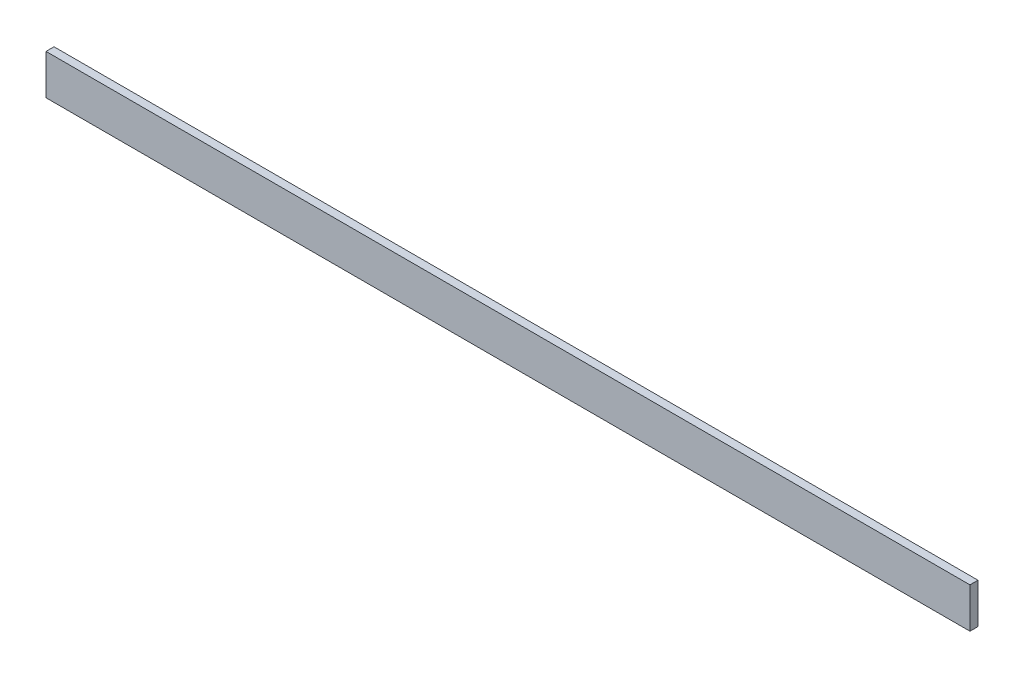
ISO-10303-21;
HEADER;
FILE_DESCRIPTION(('STEP AP214'),'2;1');
FILE_NAME('part.step','',(''),(''),'','','');
FILE_SCHEMA(('AUTOMOTIVE_DESIGN { 1 0 10303 214 1 1 1 1 }'));
ENDSEC;
DATA;
#1=APPLICATION_CONTEXT('core data for automotive mechanical design processes');
#2=APPLICATION_PROTOCOL_DEFINITION('international standard','automotive_design',2000,#1);
#3=PRODUCT_CONTEXT('',#1,'mechanical');
#4=PRODUCT('Part','Part','',(#3));
#5=PRODUCT_RELATED_PRODUCT_CATEGORY('part','',(#4));
#6=PRODUCT_DEFINITION_FORMATION('','',#4);
#7=PRODUCT_DEFINITION_CONTEXT('part definition',#1,'design');
#8=PRODUCT_DEFINITION('design','',#6,#7);
#9=PRODUCT_DEFINITION_SHAPE('','',#8);
#10=(LENGTH_UNIT() NAMED_UNIT(*) SI_UNIT(.MILLI.,.METRE.));
#11=(NAMED_UNIT(*) PLANE_ANGLE_UNIT() SI_UNIT($,.RADIAN.));
#12=(NAMED_UNIT(*) SI_UNIT($,.STERADIAN.) SOLID_ANGLE_UNIT());
#13=UNCERTAINTY_MEASURE_WITH_UNIT(LENGTH_MEASURE(1.E-05),#10,'distance_accuracy_value','');
#14=(GEOMETRIC_REPRESENTATION_CONTEXT(3) GLOBAL_UNCERTAINTY_ASSIGNED_CONTEXT((#13)) GLOBAL_UNIT_ASSIGNED_CONTEXT((#10,
#11,#12)) REPRESENTATION_CONTEXT('',''));
#15=CARTESIAN_POINT('',(0.,0.,0.));
#16=DIRECTION('',(0.,0.,1.));
#17=DIRECTION('',(1.,0.,0.));
#18=AXIS2_PLACEMENT_3D('',#15,#16,#17);
#19=CARTESIAN_POINT('',(0.,0.,4.));
#20=DIRECTION('',(1.,0.,0.));
#21=DIRECTION('',(0.,0.,-1.));
#22=AXIS2_PLACEMENT_3D('',#19,#20,#21);
#23=PLANE('',#22);
#24=DIRECTION('',(0.,-1.,0.));
#25=VECTOR('',#24,1.);
#26=CARTESIAN_POINT('',(0.,0.,0.));
#27=LINE('',#26,#25);
#28=CARTESIAN_POINT('',(0.,20.,0.));
#29=VERTEX_POINT('',#28);
#30=CARTESIAN_POINT('',(0.,0.,0.));
#31=VERTEX_POINT('',#30);
#32=EDGE_CURVE('E100',#29,#31,#27,.T.);
#33=ORIENTED_EDGE('',*,*,#32,.T.);
#34=DIRECTION('',(0.,0.,-1.));
#35=VECTOR('',#34,1.);
#36=CARTESIAN_POINT('',(0.,0.,4.));
#37=LINE('',#36,#35);
#38=CARTESIAN_POINT('',(0.,0.,4.));
#39=VERTEX_POINT('',#38);
#40=EDGE_CURVE('E11',#39,#31,#37,.T.);
#41=ORIENTED_EDGE('',*,*,#40,.F.);
#42=DIRECTION('',(0.,-1.,0.));
#43=VECTOR('',#42,1.);
#44=CARTESIAN_POINT('',(0.,0.,4.));
#45=LINE('',#44,#43);
#46=CARTESIAN_POINT('',(0.,20.,4.));
#47=VERTEX_POINT('',#46);
#48=EDGE_CURVE('E88',#47,#39,#45,.T.);
#49=ORIENTED_EDGE('',*,*,#48,.F.);
#50=DIRECTION('',(0.,0.,-1.));
#51=VECTOR('',#50,1.);
#52=CARTESIAN_POINT('',(0.,20.,4.));
#53=LINE('',#52,#51);
#54=EDGE_CURVE('E96',#47,#29,#53,.T.);
#55=ORIENTED_EDGE('',*,*,#54,.T.);
#56=EDGE_LOOP('',(#33,#41,#49,#55));
#57=FACE_BOUND('',#56,.T.);
#58=ADVANCED_FACE('F37',(#57),#23,.F.);
#59=CARTESIAN_POINT('',(0.,0.,4.));
#60=DIRECTION('',(0.,1.,0.));
#61=DIRECTION('',(0.,0.,1.));
#62=AXIS2_PLACEMENT_3D('',#59,#60,#61);
#63=PLANE('',#62);
#64=DIRECTION('',(1.,0.,0.));
#65=VECTOR('',#64,1.);
#66=CARTESIAN_POINT('',(0.,0.,0.));
#67=LINE('',#66,#65);
#68=CARTESIAN_POINT('',(460.,0.,0.));
#69=VERTEX_POINT('',#68);
#70=EDGE_CURVE('E92',#31,#69,#67,.T.);
#71=ORIENTED_EDGE('',*,*,#70,.T.);
#72=DIRECTION('',(0.,0.,-1.));
#73=VECTOR('',#72,1.);
#74=CARTESIAN_POINT('',(460.,0.,4.));
#75=LINE('',#74,#73);
#76=CARTESIAN_POINT('',(460.,0.,4.));
#77=VERTEX_POINT('',#76);
#78=EDGE_CURVE('E45',#77,#69,#75,.T.);
#79=ORIENTED_EDGE('',*,*,#78,.F.);
#80=DIRECTION('',(1.,0.,0.));
#81=VECTOR('',#80,1.);
#82=CARTESIAN_POINT('',(0.,0.,4.));
#83=LINE('',#82,#81);
#84=EDGE_CURVE('E83',#39,#77,#83,.T.);
#85=ORIENTED_EDGE('',*,*,#84,.F.);
#86=ORIENTED_EDGE('',*,*,#40,.T.);
#87=EDGE_LOOP('',(#71,#79,#85,#86));
#88=FACE_BOUND('',#87,.T.);
#89=ADVANCED_FACE('F91',(#88),#63,.F.);
#90=CARTESIAN_POINT('',(460.,0.,4.));
#91=DIRECTION('',(-1.,0.,0.));
#92=DIRECTION('',(0.,0.,1.));
#93=AXIS2_PLACEMENT_3D('',#90,#91,#92);
#94=PLANE('',#93);
#95=DIRECTION('',(0.,1.,0.));
#96=VECTOR('',#95,1.);
#97=CARTESIAN_POINT('',(460.,0.,0.));
#98=LINE('',#97,#96);
#99=CARTESIAN_POINT('',(460.,20.,0.));
#100=VERTEX_POINT('',#99);
#101=EDGE_CURVE('E70',#69,#100,#98,.T.);
#102=ORIENTED_EDGE('',*,*,#101,.T.);
#103=DIRECTION('',(0.,0.,-1.));
#104=VECTOR('',#103,1.);
#105=CARTESIAN_POINT('',(460.,20.,4.));
#106=LINE('',#105,#104);
#107=CARTESIAN_POINT('',(460.,20.,4.));
#108=VERTEX_POINT('',#107);
#109=EDGE_CURVE('E93',#108,#100,#106,.T.);
#110=ORIENTED_EDGE('',*,*,#109,.F.);
#111=DIRECTION('',(0.,1.,0.));
#112=VECTOR('',#111,1.);
#113=CARTESIAN_POINT('',(460.,0.,4.));
#114=LINE('',#113,#112);
#115=EDGE_CURVE('E86',#77,#108,#114,.T.);
#116=ORIENTED_EDGE('',*,*,#115,.F.);
#117=ORIENTED_EDGE('',*,*,#78,.T.);
#118=EDGE_LOOP('',(#102,#110,#116,#117));
#119=FACE_BOUND('',#118,.T.);
#120=ADVANCED_FACE('F94',(#119),#94,.F.);
#121=CARTESIAN_POINT('',(0.,20.,4.));
#122=DIRECTION('',(0.,-1.,0.));
#123=DIRECTION('',(0.,0.,-1.));
#124=AXIS2_PLACEMENT_3D('',#121,#122,#123);
#125=PLANE('',#124);
#126=DIRECTION('',(-1.,0.,0.));
#127=VECTOR('',#126,1.);
#128=CARTESIAN_POINT('',(0.,20.,0.));
#129=LINE('',#128,#127);
#130=EDGE_CURVE('E76',#100,#29,#129,.T.);
#131=ORIENTED_EDGE('',*,*,#130,.T.);
#132=ORIENTED_EDGE('',*,*,#54,.F.);
#133=DIRECTION('',(-1.,0.,0.));
#134=VECTOR('',#133,1.);
#135=CARTESIAN_POINT('',(0.,20.,4.));
#136=LINE('',#135,#134);
#137=EDGE_CURVE('E53',#108,#47,#136,.T.);
#138=ORIENTED_EDGE('',*,*,#137,.F.);
#139=ORIENTED_EDGE('',*,*,#109,.T.);
#140=EDGE_LOOP('',(#131,#132,#138,#139));
#141=FACE_BOUND('',#140,.T.);
#142=ADVANCED_FACE('F107',(#141),#125,.F.);
#143=CARTESIAN_POINT('',(0.,0.,4.));
#144=DIRECTION('',(0.,0.,-1.));
#145=DIRECTION('',(-1.,0.,0.));
#146=AXIS2_PLACEMENT_3D('',#143,#144,#145);
#147=PLANE('',#146);
#148=ORIENTED_EDGE('',*,*,#48,.T.);
#149=ORIENTED_EDGE('',*,*,#84,.T.);
#150=ORIENTED_EDGE('',*,*,#115,.T.);
#151=ORIENTED_EDGE('',*,*,#137,.T.);
#152=EDGE_LOOP('',(#148,#149,#150,#151));
#153=FACE_BOUND('',#152,.T.);
#154=ADVANCED_FACE('F84',(#153),#147,.F.);
#155=CARTESIAN_POINT('',(0.,0.,0.));
#156=DIRECTION('',(0.,0.,-1.));
#157=DIRECTION('',(-1.,0.,0.));
#158=AXIS2_PLACEMENT_3D('',#155,#156,#157);
#159=PLANE('',#158);
#160=ORIENTED_EDGE('',*,*,#32,.F.);
#161=ORIENTED_EDGE('',*,*,#130,.F.);
#162=ORIENTED_EDGE('',*,*,#101,.F.);
#163=ORIENTED_EDGE('',*,*,#70,.F.);
#164=EDGE_LOOP('',(#160,#161,#162,#163));
#165=FACE_BOUND('',#164,.T.);
#166=ADVANCED_FACE('F110',(#165),#159,.T.);
#167=CLOSED_SHELL('',(#58,#89,#120,#142,#154,#166));
#168=MANIFOLD_SOLID_BREP('B2',#167);
#169=ADVANCED_BREP_SHAPE_REPRESENTATION('',(#18,#168),#14);
#170=SHAPE_DEFINITION_REPRESENTATION(#9,#169);
ENDSEC;
END-ISO-10303-21;
